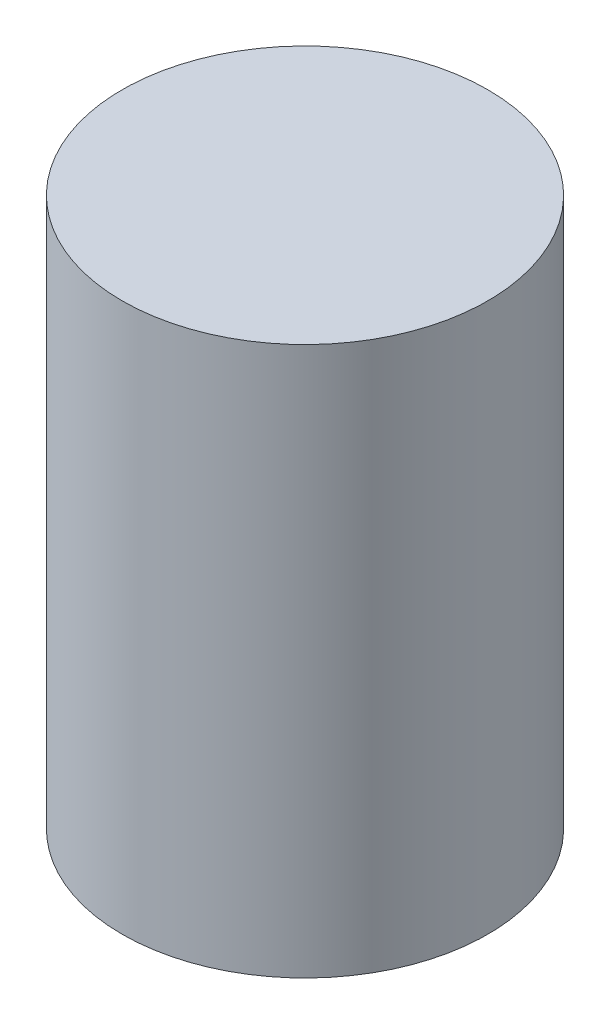
ISO-10303-21;
HEADER;
FILE_DESCRIPTION(('STEP AP214'),'2;1');
FILE_NAME('part.step','',(''),(''),'','','');
FILE_SCHEMA(('AUTOMOTIVE_DESIGN { 1 0 10303 214 1 1 1 1 }'));
ENDSEC;
DATA;
#1=APPLICATION_CONTEXT('core data for automotive mechanical design processes');
#2=APPLICATION_PROTOCOL_DEFINITION('international standard','automotive_design',2000,#1);
#3=PRODUCT_CONTEXT('',#1,'mechanical');
#4=PRODUCT('Part','Part','',(#3));
#5=PRODUCT_RELATED_PRODUCT_CATEGORY('part','',(#4));
#6=PRODUCT_DEFINITION_FORMATION('','',#4);
#7=PRODUCT_DEFINITION_CONTEXT('part definition',#1,'design');
#8=PRODUCT_DEFINITION('design','',#6,#7);
#9=PRODUCT_DEFINITION_SHAPE('','',#8);
#10=(LENGTH_UNIT() NAMED_UNIT(*) SI_UNIT(.MILLI.,.METRE.));
#11=(NAMED_UNIT(*) PLANE_ANGLE_UNIT() SI_UNIT($,.RADIAN.));
#12=(NAMED_UNIT(*) SI_UNIT($,.STERADIAN.) SOLID_ANGLE_UNIT());
#13=UNCERTAINTY_MEASURE_WITH_UNIT(LENGTH_MEASURE(1.E-05),#10,'distance_accuracy_value','');
#14=(GEOMETRIC_REPRESENTATION_CONTEXT(3) GLOBAL_UNCERTAINTY_ASSIGNED_CONTEXT((#13)) GLOBAL_UNIT_ASSIGNED_CONTEXT((#10,
#11,#12)) REPRESENTATION_CONTEXT('',''));
#15=CARTESIAN_POINT('',(0.,0.,0.));
#16=DIRECTION('',(0.,0.,1.));
#17=DIRECTION('',(1.,0.,0.));
#18=AXIS2_PLACEMENT_3D('',#15,#16,#17);
#19=CARTESIAN_POINT('',(0.,9.,0.));
#20=DIRECTION('',(0.,-1.,0.));
#21=DIRECTION('',(0.,0.,-1.));
#22=AXIS2_PLACEMENT_3D('',#19,#20,#21);
#23=CYLINDRICAL_SURFACE('',#22,3.);
#24=CARTESIAN_POINT('',(0.,9.,0.));
#25=DIRECTION('',(0.,1.,0.));
#26=DIRECTION('',(0.,0.,1.));
#27=AXIS2_PLACEMENT_3D('',#24,#25,#26);
#28=CIRCLE('',#27,3.);
#29=CARTESIAN_POINT('',(0.,9.,3.));
#30=VERTEX_POINT('',#29);
#31=EDGE_CURVE('E10',#30,#30,#28,.T.);
#32=ORIENTED_EDGE('',*,*,#31,.F.);
#33=EDGE_LOOP('',(#32));
#34=FACE_BOUND('',#33,.T.);
#35=CARTESIAN_POINT('',(0.,0.,0.));
#36=DIRECTION('',(0.,1.,0.));
#37=DIRECTION('',(0.,0.,1.));
#38=AXIS2_PLACEMENT_3D('',#35,#36,#37);
#39=CIRCLE('',#38,3.);
#40=CARTESIAN_POINT('',(0.,0.,3.));
#41=VERTEX_POINT('',#40);
#42=EDGE_CURVE('E33',#41,#41,#39,.T.);
#43=ORIENTED_EDGE('',*,*,#42,.T.);
#44=EDGE_LOOP('',(#43));
#45=FACE_BOUND('',#44,.T.);
#46=ADVANCED_FACE('F30',(#34,#45),#23,.T.);
#47=CARTESIAN_POINT('',(0.,9.,0.));
#48=DIRECTION('',(0.,1.,0.));
#49=DIRECTION('',(0.,0.,1.));
#50=AXIS2_PLACEMENT_3D('',#47,#48,#49);
#51=PLANE('',#50);
#52=ORIENTED_EDGE('',*,*,#31,.T.);
#53=EDGE_LOOP('',(#52));
#54=FACE_BOUND('',#53,.T.);
#55=ADVANCED_FACE('F45',(#54),#51,.T.);
#56=CARTESIAN_POINT('',(0.,0.,0.));
#57=DIRECTION('',(0.,1.,0.));
#58=DIRECTION('',(0.,0.,1.));
#59=AXIS2_PLACEMENT_3D('',#56,#57,#58);
#60=PLANE('',#59);
#61=ORIENTED_EDGE('',*,*,#42,.F.);
#62=EDGE_LOOP('',(#61));
#63=FACE_BOUND('',#62,.T.);
#64=ADVANCED_FACE('F43',(#63),#60,.F.);
#65=CLOSED_SHELL('',(#46,#55,#64));
#66=MANIFOLD_SOLID_BREP('B2',#65);
#67=ADVANCED_BREP_SHAPE_REPRESENTATION('',(#18,#66),#14);
#68=SHAPE_DEFINITION_REPRESENTATION(#9,#67);
ENDSEC;
END-ISO-10303-21;
